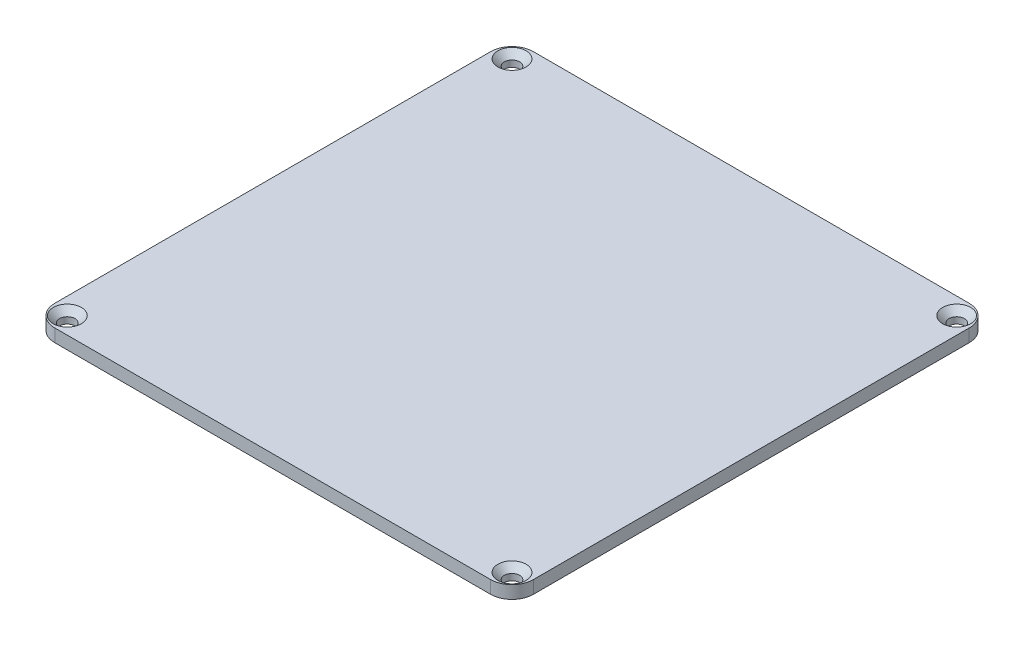
ISO-10303-21;
HEADER;
FILE_DESCRIPTION(('STEP AP214'),'2;1');
FILE_NAME('part.step','',(''),(''),'','','');
FILE_SCHEMA(('AUTOMOTIVE_DESIGN { 1 0 10303 214 1 1 1 1 }'));
ENDSEC;
DATA;
#1=APPLICATION_CONTEXT('core data for automotive mechanical design processes');
#2=APPLICATION_PROTOCOL_DEFINITION('international standard','automotive_design',2000,#1);
#3=PRODUCT_CONTEXT('',#1,'mechanical');
#4=PRODUCT('Part','Part','',(#3));
#5=PRODUCT_RELATED_PRODUCT_CATEGORY('part','',(#4));
#6=PRODUCT_DEFINITION_FORMATION('','',#4);
#7=PRODUCT_DEFINITION_CONTEXT('part definition',#1,'design');
#8=PRODUCT_DEFINITION('design','',#6,#7);
#9=PRODUCT_DEFINITION_SHAPE('','',#8);
#10=(LENGTH_UNIT() NAMED_UNIT(*) SI_UNIT(.MILLI.,.METRE.));
#11=(NAMED_UNIT(*) PLANE_ANGLE_UNIT() SI_UNIT($,.RADIAN.));
#12=(NAMED_UNIT(*) SI_UNIT($,.STERADIAN.) SOLID_ANGLE_UNIT());
#13=UNCERTAINTY_MEASURE_WITH_UNIT(LENGTH_MEASURE(1.E-05),#10,'distance_accuracy_value','');
#14=(GEOMETRIC_REPRESENTATION_CONTEXT(3) GLOBAL_UNCERTAINTY_ASSIGNED_CONTEXT((#13)) GLOBAL_UNIT_ASSIGNED_CONTEXT((#10,
#11,#12)) REPRESENTATION_CONTEXT('',''));
#15=CARTESIAN_POINT('',(0.,0.,0.));
#16=DIRECTION('',(0.,0.,1.));
#17=DIRECTION('',(1.,0.,0.));
#18=AXIS2_PLACEMENT_3D('',#15,#16,#17);
#19=CARTESIAN_POINT('',(56.,3.,-56.));
#20=DIRECTION('',(-1.,0.,0.));
#21=DIRECTION('',(0.,0.,1.));
#22=AXIS2_PLACEMENT_3D('',#19,#20,#21);
#23=PLANE('',#22);
#24=DIRECTION('',(0.,0.,-1.));
#25=VECTOR('',#24,1.);
#26=CARTESIAN_POINT('',(56.,0.,-56.));
#27=LINE('',#26,#25);
#28=CARTESIAN_POINT('',(56.,0.,51.));
#29=VERTEX_POINT('',#28);
#30=CARTESIAN_POINT('',(56.,0.,-51.));
#31=VERTEX_POINT('',#30);
#32=EDGE_CURVE('E182',#29,#31,#27,.T.);
#33=ORIENTED_EDGE('',*,*,#32,.T.);
#34=DIRECTION('',(0.,-1.,0.));
#35=VECTOR('',#34,1.);
#36=CARTESIAN_POINT('',(56.,3.,-51.));
#37=LINE('',#36,#35);
#38=CARTESIAN_POINT('',(56.,3.,-51.));
#39=VERTEX_POINT('',#38);
#40=EDGE_CURVE('E11',#31,#39,#37,.F.);
#41=ORIENTED_EDGE('',*,*,#40,.T.);
#42=DIRECTION('',(0.,0.,-1.));
#43=VECTOR('',#42,1.);
#44=CARTESIAN_POINT('',(56.,3.,-56.));
#45=LINE('',#44,#43);
#46=CARTESIAN_POINT('',(56.,3.,51.));
#47=VERTEX_POINT('',#46);
#48=EDGE_CURVE('E135',#47,#39,#45,.T.);
#49=ORIENTED_EDGE('',*,*,#48,.F.);
#50=DIRECTION('',(0.,-1.,0.));
#51=VECTOR('',#50,1.);
#52=CARTESIAN_POINT('',(56.,3.,51.));
#53=LINE('',#52,#51);
#54=EDGE_CURVE('E48',#47,#29,#53,.T.);
#55=ORIENTED_EDGE('',*,*,#54,.T.);
#56=EDGE_LOOP('',(#33,#41,#49,#55));
#57=FACE_BOUND('',#56,.T.);
#58=ADVANCED_FACE('F39',(#57),#23,.F.);
#59=CARTESIAN_POINT('',(-56.,3.,-56.));
#60=DIRECTION('',(0.,0.,1.));
#61=DIRECTION('',(1.,0.,0.));
#62=AXIS2_PLACEMENT_3D('',#59,#60,#61);
#63=PLANE('',#62);
#64=DIRECTION('',(-1.,0.,0.));
#65=VECTOR('',#64,1.);
#66=CARTESIAN_POINT('',(-56.,0.,-56.));
#67=LINE('',#66,#65);
#68=CARTESIAN_POINT('',(51.,0.,-56.));
#69=VERTEX_POINT('',#68);
#70=CARTESIAN_POINT('',(-51.,0.,-56.));
#71=VERTEX_POINT('',#70);
#72=EDGE_CURVE('E142',#69,#71,#67,.T.);
#73=ORIENTED_EDGE('',*,*,#72,.T.);
#74=DIRECTION('',(0.,-1.,0.));
#75=VECTOR('',#74,1.);
#76=CARTESIAN_POINT('',(-51.,3.,-56.));
#77=LINE('',#76,#75);
#78=CARTESIAN_POINT('',(-51.,3.,-56.));
#79=VERTEX_POINT('',#78);
#80=EDGE_CURVE('E55',#71,#79,#77,.F.);
#81=ORIENTED_EDGE('',*,*,#80,.T.);
#82=DIRECTION('',(-1.,0.,0.));
#83=VECTOR('',#82,1.);
#84=CARTESIAN_POINT('',(-56.,3.,-56.));
#85=LINE('',#84,#83);
#86=CARTESIAN_POINT('',(51.,3.,-56.));
#87=VERTEX_POINT('',#86);
#88=EDGE_CURVE('E140',#87,#79,#85,.T.);
#89=ORIENTED_EDGE('',*,*,#88,.F.);
#90=DIRECTION('',(0.,-1.,0.));
#91=VECTOR('',#90,1.);
#92=CARTESIAN_POINT('',(51.,3.,-56.));
#93=LINE('',#92,#91);
#94=EDGE_CURVE('E171',#87,#69,#93,.T.);
#95=ORIENTED_EDGE('',*,*,#94,.T.);
#96=EDGE_LOOP('',(#73,#81,#89,#95));
#97=FACE_BOUND('',#96,.T.);
#98=ADVANCED_FACE('F266',(#97),#63,.F.);
#99=CARTESIAN_POINT('',(-56.,3.,-56.));
#100=DIRECTION('',(1.,0.,0.));
#101=DIRECTION('',(0.,0.,-1.));
#102=AXIS2_PLACEMENT_3D('',#99,#100,#101);
#103=PLANE('',#102);
#104=DIRECTION('',(0.,0.,1.));
#105=VECTOR('',#104,1.);
#106=CARTESIAN_POINT('',(-56.,0.,-56.));
#107=LINE('',#106,#105);
#108=CARTESIAN_POINT('',(-56.,0.,-51.));
#109=VERTEX_POINT('',#108);
#110=CARTESIAN_POINT('',(-56.,0.,51.));
#111=VERTEX_POINT('',#110);
#112=EDGE_CURVE('E136',#109,#111,#107,.T.);
#113=ORIENTED_EDGE('',*,*,#112,.T.);
#114=DIRECTION('',(0.,-1.,0.));
#115=VECTOR('',#114,1.);
#116=CARTESIAN_POINT('',(-56.,3.,51.));
#117=LINE('',#116,#115);
#118=CARTESIAN_POINT('',(-56.,3.,51.));
#119=VERTEX_POINT('',#118);
#120=EDGE_CURVE('E111',#111,#119,#117,.F.);
#121=ORIENTED_EDGE('',*,*,#120,.T.);
#122=DIRECTION('',(0.,0.,1.));
#123=VECTOR('',#122,1.);
#124=CARTESIAN_POINT('',(-56.,3.,-56.));
#125=LINE('',#124,#123);
#126=CARTESIAN_POINT('',(-56.,3.,-51.));
#127=VERTEX_POINT('',#126);
#128=EDGE_CURVE('E198',#127,#119,#125,.T.);
#129=ORIENTED_EDGE('',*,*,#128,.F.);
#130=DIRECTION('',(0.,-1.,0.));
#131=VECTOR('',#130,1.);
#132=CARTESIAN_POINT('',(-56.,3.,-51.));
#133=LINE('',#132,#131);
#134=EDGE_CURVE('E117',#127,#109,#133,.T.);
#135=ORIENTED_EDGE('',*,*,#134,.T.);
#136=EDGE_LOOP('',(#113,#121,#129,#135));
#137=FACE_BOUND('',#136,.T.);
#138=ADVANCED_FACE('F263',(#137),#103,.F.);
#139=CARTESIAN_POINT('',(-56.,3.,56.));
#140=DIRECTION('',(0.,0.,-1.));
#141=DIRECTION('',(-1.,0.,0.));
#142=AXIS2_PLACEMENT_3D('',#139,#140,#141);
#143=PLANE('',#142);
#144=DIRECTION('',(1.,0.,0.));
#145=VECTOR('',#144,1.);
#146=CARTESIAN_POINT('',(-56.,3.,56.));
#147=LINE('',#146,#145);
#148=CARTESIAN_POINT('',(-51.,3.,56.));
#149=VERTEX_POINT('',#148);
#150=CARTESIAN_POINT('',(51.,3.,56.));
#151=VERTEX_POINT('',#150);
#152=EDGE_CURVE('E127',#149,#151,#147,.T.);
#153=ORIENTED_EDGE('',*,*,#152,.F.);
#154=DIRECTION('',(0.,-1.,0.));
#155=VECTOR('',#154,1.);
#156=CARTESIAN_POINT('',(-51.,3.,56.));
#157=LINE('',#156,#155);
#158=CARTESIAN_POINT('',(-51.,0.,56.));
#159=VERTEX_POINT('',#158);
#160=EDGE_CURVE('E110',#149,#159,#157,.T.);
#161=ORIENTED_EDGE('',*,*,#160,.T.);
#162=DIRECTION('',(1.,0.,0.));
#163=VECTOR('',#162,1.);
#164=CARTESIAN_POINT('',(-56.,0.,56.));
#165=LINE('',#164,#163);
#166=CARTESIAN_POINT('',(51.,0.,56.));
#167=VERTEX_POINT('',#166);
#168=EDGE_CURVE('E124',#159,#167,#165,.T.);
#169=ORIENTED_EDGE('',*,*,#168,.T.);
#170=DIRECTION('',(0.,-1.,0.));
#171=VECTOR('',#170,1.);
#172=CARTESIAN_POINT('',(51.,3.,56.));
#173=LINE('',#172,#171);
#174=EDGE_CURVE('E130',#167,#151,#173,.F.);
#175=ORIENTED_EDGE('',*,*,#174,.T.);
#176=EDGE_LOOP('',(#153,#161,#169,#175));
#177=FACE_BOUND('',#176,.T.);
#178=ADVANCED_FACE('F123',(#177),#143,.F.);
#179=CARTESIAN_POINT('',(0.,3.,0.));
#180=DIRECTION('',(0.,1.,0.));
#181=DIRECTION('',(0.,0.,1.));
#182=AXIS2_PLACEMENT_3D('',#179,#180,#181);
#183=PLANE('',#182);
#184=CARTESIAN_POINT('',(52.035,3.,52.035));
#185=DIRECTION('',(0.,1.,0.));
#186=DIRECTION('',(0.,0.,1.));
#187=AXIS2_PLACEMENT_3D('',#184,#185,#186);
#188=CIRCLE('',#187,3.3);
#189=CARTESIAN_POINT('',(52.035,3.,55.335));
#190=VERTEX_POINT('',#189);
#191=EDGE_CURVE('E243',#190,#190,#188,.T.);
#192=ORIENTED_EDGE('',*,*,#191,.F.);
#193=EDGE_LOOP('',(#192));
#194=FACE_BOUND('',#193,.T.);
#195=CARTESIAN_POINT('',(-52.035,3.,-52.035));
#196=DIRECTION('',(0.,1.,0.));
#197=DIRECTION('',(0.,0.,1.));
#198=AXIS2_PLACEMENT_3D('',#195,#196,#197);
#199=CIRCLE('',#198,3.3);
#200=CARTESIAN_POINT('',(-52.035,3.,-48.735));
#201=VERTEX_POINT('',#200);
#202=EDGE_CURVE('E231',#201,#201,#199,.T.);
#203=ORIENTED_EDGE('',*,*,#202,.F.);
#204=EDGE_LOOP('',(#203));
#205=FACE_BOUND('',#204,.T.);
#206=CARTESIAN_POINT('',(-52.035,3.,52.035));
#207=DIRECTION('',(0.,1.,0.));
#208=DIRECTION('',(0.,0.,1.));
#209=AXIS2_PLACEMENT_3D('',#206,#207,#208);
#210=CIRCLE('',#209,3.3);
#211=CARTESIAN_POINT('',(-52.035,3.,55.335));
#212=VERTEX_POINT('',#211);
#213=EDGE_CURVE('E219',#212,#212,#210,.T.);
#214=ORIENTED_EDGE('',*,*,#213,.F.);
#215=EDGE_LOOP('',(#214));
#216=FACE_BOUND('',#215,.T.);
#217=CARTESIAN_POINT('',(52.035,3.,-52.035));
#218=DIRECTION('',(0.,1.,0.));
#219=DIRECTION('',(0.,0.,1.));
#220=AXIS2_PLACEMENT_3D('',#217,#218,#219);
#221=CIRCLE('',#220,3.3);
#222=CARTESIAN_POINT('',(52.035,3.,-48.735));
#223=VERTEX_POINT('',#222);
#224=EDGE_CURVE('E207',#223,#223,#221,.T.);
#225=ORIENTED_EDGE('',*,*,#224,.F.);
#226=EDGE_LOOP('',(#225));
#227=FACE_BOUND('',#226,.T.);
#228=ORIENTED_EDGE('',*,*,#128,.T.);
#229=CARTESIAN_POINT('',(-51.,3.,51.));
#230=DIRECTION('',(0.,1.,0.));
#231=DIRECTION('',(0.,0.,1.));
#232=AXIS2_PLACEMENT_3D('',#229,#230,#231);
#233=CIRCLE('',#232,5.);
#234=EDGE_CURVE('E168',#119,#149,#233,.T.);
#235=ORIENTED_EDGE('',*,*,#234,.T.);
#236=ORIENTED_EDGE('',*,*,#152,.T.);
#237=CARTESIAN_POINT('',(51.,3.,51.));
#238=DIRECTION('',(0.,1.,0.));
#239=DIRECTION('',(0.,0.,1.));
#240=AXIS2_PLACEMENT_3D('',#237,#238,#239);
#241=CIRCLE('',#240,5.);
#242=EDGE_CURVE('E160',#151,#47,#241,.T.);
#243=ORIENTED_EDGE('',*,*,#242,.T.);
#244=ORIENTED_EDGE('',*,*,#48,.T.);
#245=CARTESIAN_POINT('',(51.,3.,-51.));
#246=DIRECTION('',(0.,1.,0.));
#247=DIRECTION('',(0.,0.,1.));
#248=AXIS2_PLACEMENT_3D('',#245,#246,#247);
#249=CIRCLE('',#248,5.);
#250=EDGE_CURVE('E62',#39,#87,#249,.T.);
#251=ORIENTED_EDGE('',*,*,#250,.T.);
#252=ORIENTED_EDGE('',*,*,#88,.T.);
#253=CARTESIAN_POINT('',(-51.,3.,-51.));
#254=DIRECTION('',(0.,1.,0.));
#255=DIRECTION('',(0.,0.,1.));
#256=AXIS2_PLACEMENT_3D('',#253,#254,#255);
#257=CIRCLE('',#256,5.);
#258=EDGE_CURVE('E165',#79,#127,#257,.T.);
#259=ORIENTED_EDGE('',*,*,#258,.T.);
#260=EDGE_LOOP('',(#228,#235,#236,#243,#244,#251,#252,#259));
#261=FACE_BOUND('',#260,.T.);
#262=ADVANCED_FACE('F250',(#194,#205,#216,#227,#261),#183,.T.);
#263=CARTESIAN_POINT('',(0.,0.,0.));
#264=DIRECTION('',(0.,1.,0.));
#265=DIRECTION('',(0.,0.,1.));
#266=AXIS2_PLACEMENT_3D('',#263,#264,#265);
#267=PLANE('',#266);
#268=CARTESIAN_POINT('',(52.035,0.,52.035));
#269=DIRECTION('',(0.,1.,0.));
#270=DIRECTION('',(0.,0.,1.));
#271=AXIS2_PLACEMENT_3D('',#268,#269,#270);
#272=CIRCLE('',#271,1.8);
#273=CARTESIAN_POINT('',(52.035,0.,53.835));
#274=VERTEX_POINT('',#273);
#275=EDGE_CURVE('E235',#274,#274,#272,.T.);
#276=ORIENTED_EDGE('',*,*,#275,.T.);
#277=EDGE_LOOP('',(#276));
#278=FACE_BOUND('',#277,.T.);
#279=CARTESIAN_POINT('',(-52.035,0.,-52.035));
#280=DIRECTION('',(0.,1.,0.));
#281=DIRECTION('',(0.,0.,1.));
#282=AXIS2_PLACEMENT_3D('',#279,#280,#281);
#283=CIRCLE('',#282,1.8);
#284=CARTESIAN_POINT('',(-52.035,0.,-50.235));
#285=VERTEX_POINT('',#284);
#286=EDGE_CURVE('E223',#285,#285,#283,.T.);
#287=ORIENTED_EDGE('',*,*,#286,.T.);
#288=EDGE_LOOP('',(#287));
#289=FACE_BOUND('',#288,.T.);
#290=CARTESIAN_POINT('',(-52.035,0.,52.035));
#291=DIRECTION('',(0.,1.,0.));
#292=DIRECTION('',(0.,0.,1.));
#293=AXIS2_PLACEMENT_3D('',#290,#291,#292);
#294=CIRCLE('',#293,1.8);
#295=CARTESIAN_POINT('',(-52.035,0.,53.835));
#296=VERTEX_POINT('',#295);
#297=EDGE_CURVE('E211',#296,#296,#294,.T.);
#298=ORIENTED_EDGE('',*,*,#297,.T.);
#299=EDGE_LOOP('',(#298));
#300=FACE_BOUND('',#299,.T.);
#301=CARTESIAN_POINT('',(52.035,0.,-52.035));
#302=DIRECTION('',(0.,1.,0.));
#303=DIRECTION('',(0.,0.,1.));
#304=AXIS2_PLACEMENT_3D('',#301,#302,#303);
#305=CIRCLE('',#304,1.8);
#306=CARTESIAN_POINT('',(52.035,0.,-50.235));
#307=VERTEX_POINT('',#306);
#308=EDGE_CURVE('E188',#307,#307,#305,.T.);
#309=ORIENTED_EDGE('',*,*,#308,.T.);
#310=EDGE_LOOP('',(#309));
#311=FACE_BOUND('',#310,.T.);
#312=ORIENTED_EDGE('',*,*,#168,.F.);
#313=CARTESIAN_POINT('',(-51.,0.,51.));
#314=DIRECTION('',(0.,1.,0.));
#315=DIRECTION('',(0.,0.,1.));
#316=AXIS2_PLACEMENT_3D('',#313,#314,#315);
#317=CIRCLE('',#316,5.);
#318=EDGE_CURVE('E106',#159,#111,#317,.F.);
#319=ORIENTED_EDGE('',*,*,#318,.T.);
#320=ORIENTED_EDGE('',*,*,#112,.F.);
#321=CARTESIAN_POINT('',(-51.,0.,-51.));
#322=DIRECTION('',(0.,1.,0.));
#323=DIRECTION('',(0.,0.,1.));
#324=AXIS2_PLACEMENT_3D('',#321,#322,#323);
#325=CIRCLE('',#324,5.);
#326=EDGE_CURVE('E118',#109,#71,#325,.F.);
#327=ORIENTED_EDGE('',*,*,#326,.T.);
#328=ORIENTED_EDGE('',*,*,#72,.F.);
#329=CARTESIAN_POINT('',(51.,0.,-51.));
#330=DIRECTION('',(0.,1.,0.));
#331=DIRECTION('',(0.,0.,1.));
#332=AXIS2_PLACEMENT_3D('',#329,#330,#331);
#333=CIRCLE('',#332,5.);
#334=EDGE_CURVE('E150',#69,#31,#333,.F.);
#335=ORIENTED_EDGE('',*,*,#334,.T.);
#336=ORIENTED_EDGE('',*,*,#32,.F.);
#337=CARTESIAN_POINT('',(51.,0.,51.));
#338=DIRECTION('',(0.,1.,0.));
#339=DIRECTION('',(0.,0.,1.));
#340=AXIS2_PLACEMENT_3D('',#337,#338,#339);
#341=CIRCLE('',#340,5.);
#342=EDGE_CURVE('E129',#29,#167,#341,.F.);
#343=ORIENTED_EDGE('',*,*,#342,.T.);
#344=EDGE_LOOP('',(#312,#319,#320,#327,#328,#335,#336,#343));
#345=FACE_BOUND('',#344,.T.);
#346=ADVANCED_FACE('F132',(#278,#289,#300,#311,#345),#267,.F.);
#347=CARTESIAN_POINT('',(52.035,3.,-52.035));
#348=DIRECTION('',(0.,1.,0.));
#349=DIRECTION('',(0.,0.,1.));
#350=AXIS2_PLACEMENT_3D('',#347,#348,#349);
#351=CYLINDRICAL_SURFACE('',#350,1.8);
#352=ORIENTED_EDGE('',*,*,#308,.F.);
#353=EDGE_LOOP('',(#352));
#354=FACE_BOUND('',#353,.T.);
#355=CARTESIAN_POINT('',(52.035,1.5,-52.035));
#356=DIRECTION('',(0.,1.,0.));
#357=DIRECTION('',(0.,0.,1.));
#358=AXIS2_PLACEMENT_3D('',#355,#356,#357);
#359=CIRCLE('',#358,1.79999999999999);
#360=CARTESIAN_POINT('',(52.035,1.5,-50.235));
#361=VERTEX_POINT('',#360);
#362=EDGE_CURVE('E193',#361,#361,#359,.T.);
#363=ORIENTED_EDGE('',*,*,#362,.T.);
#364=EDGE_LOOP('',(#363));
#365=FACE_BOUND('',#364,.T.);
#366=ADVANCED_FACE('F368',(#354,#365),#351,.F.);
#367=CARTESIAN_POINT('',(52.035,3.,-52.035));
#368=DIRECTION('',(0.,1.,0.));
#369=DIRECTION('',(0.,0.,1.));
#370=AXIS2_PLACEMENT_3D('',#367,#368,#369);
#371=CONICAL_SURFACE('',#370,3.3,0.785398163397452);
#372=ORIENTED_EDGE('',*,*,#362,.F.);
#373=EDGE_LOOP('',(#372));
#374=FACE_BOUND('',#373,.T.);
#375=ORIENTED_EDGE('',*,*,#224,.T.);
#376=EDGE_LOOP('',(#375));
#377=FACE_BOUND('',#376,.T.);
#378=ADVANCED_FACE('F359',(#374,#377),#371,.F.);
#379=CARTESIAN_POINT('',(-52.035,3.,52.035));
#380=DIRECTION('',(0.,1.,0.));
#381=DIRECTION('',(0.,0.,1.));
#382=AXIS2_PLACEMENT_3D('',#379,#380,#381);
#383=CYLINDRICAL_SURFACE('',#382,1.8);
#384=ORIENTED_EDGE('',*,*,#297,.F.);
#385=EDGE_LOOP('',(#384));
#386=FACE_BOUND('',#385,.T.);
#387=CARTESIAN_POINT('',(-52.035,1.5,52.035));
#388=DIRECTION('',(0.,1.,0.));
#389=DIRECTION('',(0.,0.,1.));
#390=AXIS2_PLACEMENT_3D('',#387,#388,#389);
#391=CIRCLE('',#390,1.79999999999999);
#392=CARTESIAN_POINT('',(-52.035,1.5,53.835));
#393=VERTEX_POINT('',#392);
#394=EDGE_CURVE('E215',#393,#393,#391,.T.);
#395=ORIENTED_EDGE('',*,*,#394,.T.);
#396=EDGE_LOOP('',(#395));
#397=FACE_BOUND('',#396,.T.);
#398=ADVANCED_FACE('F350',(#386,#397),#383,.F.);
#399=CARTESIAN_POINT('',(-52.035,3.,52.035));
#400=DIRECTION('',(0.,1.,0.));
#401=DIRECTION('',(0.,0.,1.));
#402=AXIS2_PLACEMENT_3D('',#399,#400,#401);
#403=CONICAL_SURFACE('',#402,3.3,0.785398163397452);
#404=ORIENTED_EDGE('',*,*,#394,.F.);
#405=EDGE_LOOP('',(#404));
#406=FACE_BOUND('',#405,.T.);
#407=ORIENTED_EDGE('',*,*,#213,.T.);
#408=EDGE_LOOP('',(#407));
#409=FACE_BOUND('',#408,.T.);
#410=ADVANCED_FACE('F341',(#406,#409),#403,.F.);
#411=CARTESIAN_POINT('',(-52.035,3.,-52.035));
#412=DIRECTION('',(0.,1.,0.));
#413=DIRECTION('',(0.,0.,1.));
#414=AXIS2_PLACEMENT_3D('',#411,#412,#413);
#415=CYLINDRICAL_SURFACE('',#414,1.8);
#416=ORIENTED_EDGE('',*,*,#286,.F.);
#417=EDGE_LOOP('',(#416));
#418=FACE_BOUND('',#417,.T.);
#419=CARTESIAN_POINT('',(-52.035,1.5,-52.035));
#420=DIRECTION('',(0.,1.,0.));
#421=DIRECTION('',(0.,0.,1.));
#422=AXIS2_PLACEMENT_3D('',#419,#420,#421);
#423=CIRCLE('',#422,1.79999999999999);
#424=CARTESIAN_POINT('',(-52.035,1.5,-50.235));
#425=VERTEX_POINT('',#424);
#426=EDGE_CURVE('E227',#425,#425,#423,.T.);
#427=ORIENTED_EDGE('',*,*,#426,.T.);
#428=EDGE_LOOP('',(#427));
#429=FACE_BOUND('',#428,.T.);
#430=ADVANCED_FACE('F332',(#418,#429),#415,.F.);
#431=CARTESIAN_POINT('',(-52.035,3.,-52.035));
#432=DIRECTION('',(0.,1.,0.));
#433=DIRECTION('',(0.,0.,1.));
#434=AXIS2_PLACEMENT_3D('',#431,#432,#433);
#435=CONICAL_SURFACE('',#434,3.3,0.785398163397452);
#436=ORIENTED_EDGE('',*,*,#426,.F.);
#437=EDGE_LOOP('',(#436));
#438=FACE_BOUND('',#437,.T.);
#439=ORIENTED_EDGE('',*,*,#202,.T.);
#440=EDGE_LOOP('',(#439));
#441=FACE_BOUND('',#440,.T.);
#442=ADVANCED_FACE('F323',(#438,#441),#435,.F.);
#443=CARTESIAN_POINT('',(52.035,3.,52.035));
#444=DIRECTION('',(0.,1.,0.));
#445=DIRECTION('',(0.,0.,1.));
#446=AXIS2_PLACEMENT_3D('',#443,#444,#445);
#447=CYLINDRICAL_SURFACE('',#446,1.8);
#448=ORIENTED_EDGE('',*,*,#275,.F.);
#449=EDGE_LOOP('',(#448));
#450=FACE_BOUND('',#449,.T.);
#451=CARTESIAN_POINT('',(52.035,1.5,52.035));
#452=DIRECTION('',(0.,1.,0.));
#453=DIRECTION('',(0.,0.,1.));
#454=AXIS2_PLACEMENT_3D('',#451,#452,#453);
#455=CIRCLE('',#454,1.79999999999999);
#456=CARTESIAN_POINT('',(52.035,1.5,53.835));
#457=VERTEX_POINT('',#456);
#458=EDGE_CURVE('E239',#457,#457,#455,.T.);
#459=ORIENTED_EDGE('',*,*,#458,.T.);
#460=EDGE_LOOP('',(#459));
#461=FACE_BOUND('',#460,.T.);
#462=ADVANCED_FACE('F314',(#450,#461),#447,.F.);
#463=CARTESIAN_POINT('',(52.035,3.,52.035));
#464=DIRECTION('',(0.,1.,0.));
#465=DIRECTION('',(0.,0.,1.));
#466=AXIS2_PLACEMENT_3D('',#463,#464,#465);
#467=CONICAL_SURFACE('',#466,3.3,0.785398163397452);
#468=ORIENTED_EDGE('',*,*,#458,.F.);
#469=EDGE_LOOP('',(#468));
#470=FACE_BOUND('',#469,.T.);
#471=ORIENTED_EDGE('',*,*,#191,.T.);
#472=EDGE_LOOP('',(#471));
#473=FACE_BOUND('',#472,.T.);
#474=ADVANCED_FACE('F248',(#470,#473),#467,.F.);
#475=CARTESIAN_POINT('',(-51.,3.,51.));
#476=DIRECTION('',(0.,-1.,0.));
#477=DIRECTION('',(0.,0.,-1.));
#478=AXIS2_PLACEMENT_3D('',#475,#476,#477);
#479=CYLINDRICAL_SURFACE('',#478,5.);
#480=ORIENTED_EDGE('',*,*,#234,.F.);
#481=ORIENTED_EDGE('',*,*,#120,.F.);
#482=ORIENTED_EDGE('',*,*,#318,.F.);
#483=ORIENTED_EDGE('',*,*,#160,.F.);
#484=EDGE_LOOP('',(#480,#481,#482,#483));
#485=FACE_BOUND('',#484,.T.);
#486=ADVANCED_FACE('F109',(#485),#479,.T.);
#487=CARTESIAN_POINT('',(-51.,3.,-51.));
#488=DIRECTION('',(0.,-1.,0.));
#489=DIRECTION('',(0.,0.,-1.));
#490=AXIS2_PLACEMENT_3D('',#487,#488,#489);
#491=CYLINDRICAL_SURFACE('',#490,5.);
#492=ORIENTED_EDGE('',*,*,#258,.F.);
#493=ORIENTED_EDGE('',*,*,#80,.F.);
#494=ORIENTED_EDGE('',*,*,#326,.F.);
#495=ORIENTED_EDGE('',*,*,#134,.F.);
#496=EDGE_LOOP('',(#492,#493,#494,#495));
#497=FACE_BOUND('',#496,.T.);
#498=ADVANCED_FACE('F265',(#497),#491,.T.);
#499=CARTESIAN_POINT('',(51.,3.,-51.));
#500=DIRECTION('',(0.,-1.,0.));
#501=DIRECTION('',(0.,0.,-1.));
#502=AXIS2_PLACEMENT_3D('',#499,#500,#501);
#503=CYLINDRICAL_SURFACE('',#502,5.);
#504=ORIENTED_EDGE('',*,*,#250,.F.);
#505=ORIENTED_EDGE('',*,*,#40,.F.);
#506=ORIENTED_EDGE('',*,*,#334,.F.);
#507=ORIENTED_EDGE('',*,*,#94,.F.);
#508=EDGE_LOOP('',(#504,#505,#506,#507));
#509=FACE_BOUND('',#508,.T.);
#510=ADVANCED_FACE('F269',(#509),#503,.T.);
#511=CARTESIAN_POINT('',(51.,3.,51.));
#512=DIRECTION('',(0.,-1.,0.));
#513=DIRECTION('',(0.,0.,-1.));
#514=AXIS2_PLACEMENT_3D('',#511,#512,#513);
#515=CYLINDRICAL_SURFACE('',#514,5.);
#516=ORIENTED_EDGE('',*,*,#242,.F.);
#517=ORIENTED_EDGE('',*,*,#174,.F.);
#518=ORIENTED_EDGE('',*,*,#342,.F.);
#519=ORIENTED_EDGE('',*,*,#54,.F.);
#520=EDGE_LOOP('',(#516,#517,#518,#519));
#521=FACE_BOUND('',#520,.T.);
#522=ADVANCED_FACE('F41',(#521),#515,.T.);
#523=CLOSED_SHELL('',(#58,#98,#138,#178,#262,#346,#366,#378,#398,#410,#430,#442,#462,#474,#486,
#498,#510,#522));
#524=MANIFOLD_SOLID_BREP('B2',#523);
#525=ADVANCED_BREP_SHAPE_REPRESENTATION('',(#18,#524),#14);
#526=SHAPE_DEFINITION_REPRESENTATION(#9,#525);
ENDSEC;
END-ISO-10303-21;
